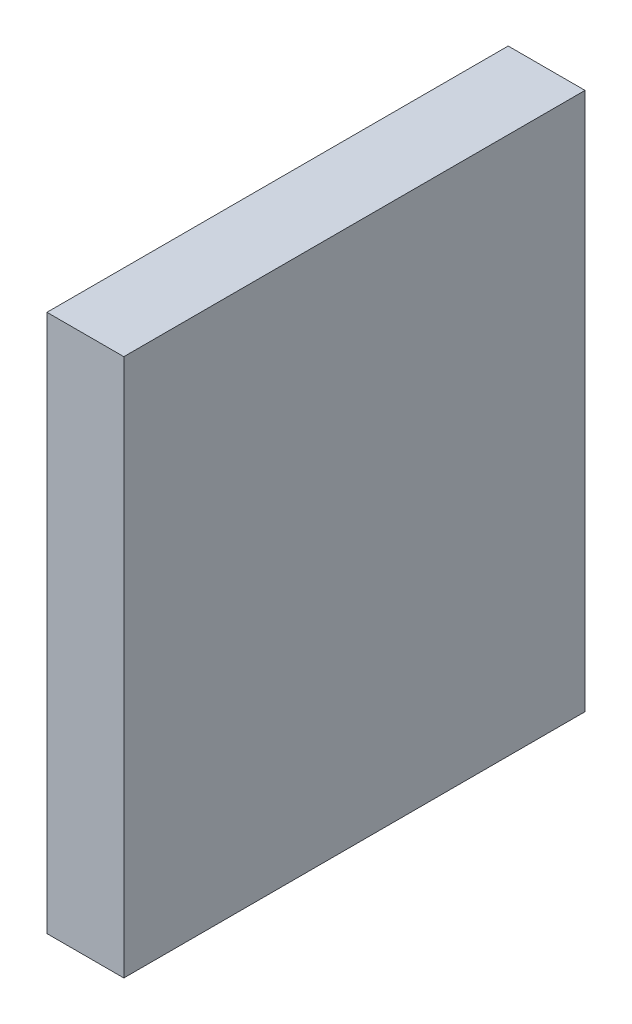
ISO-10303-21;
HEADER;
FILE_DESCRIPTION(('STEP AP214'),'2;1');
FILE_NAME('part.step','',(''),(''),'','','');
FILE_SCHEMA(('AUTOMOTIVE_DESIGN { 1 0 10303 214 1 1 1 1 }'));
ENDSEC;
DATA;
#1=APPLICATION_CONTEXT('core data for automotive mechanical design processes');
#2=APPLICATION_PROTOCOL_DEFINITION('international standard','automotive_design',2000,#1);
#3=PRODUCT_CONTEXT('',#1,'mechanical');
#4=PRODUCT('Part','Part','',(#3));
#5=PRODUCT_RELATED_PRODUCT_CATEGORY('part','',(#4));
#6=PRODUCT_DEFINITION_FORMATION('','',#4);
#7=PRODUCT_DEFINITION_CONTEXT('part definition',#1,'design');
#8=PRODUCT_DEFINITION('design','',#6,#7);
#9=PRODUCT_DEFINITION_SHAPE('','',#8);
#10=(LENGTH_UNIT() NAMED_UNIT(*) SI_UNIT(.MILLI.,.METRE.));
#11=(NAMED_UNIT(*) PLANE_ANGLE_UNIT() SI_UNIT($,.RADIAN.));
#12=(NAMED_UNIT(*) SI_UNIT($,.STERADIAN.) SOLID_ANGLE_UNIT());
#13=UNCERTAINTY_MEASURE_WITH_UNIT(LENGTH_MEASURE(1.E-05),#10,'distance_accuracy_value','');
#14=(GEOMETRIC_REPRESENTATION_CONTEXT(3) GLOBAL_UNCERTAINTY_ASSIGNED_CONTEXT((#13)) GLOBAL_UNIT_ASSIGNED_CONTEXT((#10,
#11,#12)) REPRESENTATION_CONTEXT('',''));
#15=CARTESIAN_POINT('',(0.,0.,0.));
#16=DIRECTION('',(0.,0.,1.));
#17=DIRECTION('',(1.,0.,0.));
#18=AXIS2_PLACEMENT_3D('',#15,#16,#17);
#19=CARTESIAN_POINT('',(24.1,1.87,14.26));
#20=DIRECTION('',(-1.,0.,0.));
#21=DIRECTION('',(0.,0.,1.));
#22=AXIS2_PLACEMENT_3D('',#19,#20,#21);
#23=PLANE('',#22);
#24=DIRECTION('',(0.,0.,1.));
#25=VECTOR('',#24,1.);
#26=CARTESIAN_POINT('',(24.1,2.22,14.56));
#27=LINE('',#26,#25);
#28=CARTESIAN_POINT('',(24.1,2.22,14.56));
#29=VERTEX_POINT('',#28);
#30=CARTESIAN_POINT('',(24.1,2.22,13.96));
#31=VERTEX_POINT('',#30);
#32=EDGE_CURVE('E79',#29,#31,#27,.F.);
#33=ORIENTED_EDGE('',*,*,#32,.F.);
#34=DIRECTION('',(0.,1.,0.));
#35=VECTOR('',#34,1.);
#36=CARTESIAN_POINT('',(24.1,1.52,14.56));
#37=LINE('',#36,#35);
#38=CARTESIAN_POINT('',(24.1,1.52,14.56));
#39=VERTEX_POINT('',#38);
#40=EDGE_CURVE('E55',#39,#29,#37,.T.);
#41=ORIENTED_EDGE('',*,*,#40,.F.);
#42=DIRECTION('',(0.,0.,-1.));
#43=VECTOR('',#42,1.);
#44=CARTESIAN_POINT('',(24.1,1.52,13.96));
#45=LINE('',#44,#43);
#46=CARTESIAN_POINT('',(24.1,1.52,13.96));
#47=VERTEX_POINT('',#46);
#48=EDGE_CURVE('E57',#47,#39,#45,.F.);
#49=ORIENTED_EDGE('',*,*,#48,.F.);
#50=DIRECTION('',(0.,1.,0.));
#51=VECTOR('',#50,1.);
#52=CARTESIAN_POINT('',(24.1,2.22,13.96));
#53=LINE('',#52,#51);
#54=EDGE_CURVE('E20',#31,#47,#53,.F.);
#55=ORIENTED_EDGE('',*,*,#54,.F.);
#56=EDGE_LOOP('',(#33,#41,#49,#55));
#57=FACE_BOUND('',#56,.T.);
#58=ADVANCED_FACE('F17',(#57),#23,.F.);
#59=CARTESIAN_POINT('',(24.1,2.22,13.96));
#60=DIRECTION('',(0.,0.,-1.));
#61=DIRECTION('',(-1.,0.,0.));
#62=AXIS2_PLACEMENT_3D('',#59,#60,#61);
#63=PLANE('',#62);
#64=DIRECTION('',(0.,1.,0.));
#65=VECTOR('',#64,1.);
#66=CARTESIAN_POINT('',(24.,1.87,13.96));
#67=LINE('',#66,#65);
#68=CARTESIAN_POINT('',(24.,2.22,13.96));
#69=VERTEX_POINT('',#68);
#70=CARTESIAN_POINT('',(24.,1.52,13.96));
#71=VERTEX_POINT('',#70);
#72=EDGE_CURVE('E83',#69,#71,#67,.F.);
#73=ORIENTED_EDGE('',*,*,#72,.F.);
#74=DIRECTION('',(1.,0.,0.));
#75=VECTOR('',#74,1.);
#76=CARTESIAN_POINT('',(24.1,2.22,13.96));
#77=LINE('',#76,#75);
#78=EDGE_CURVE('E68',#31,#69,#77,.F.);
#79=ORIENTED_EDGE('',*,*,#78,.F.);
#80=ORIENTED_EDGE('',*,*,#54,.T.);
#81=DIRECTION('',(1.,0.,0.));
#82=VECTOR('',#81,1.);
#83=CARTESIAN_POINT('',(24.1,1.52,13.96));
#84=LINE('',#83,#82);
#85=EDGE_CURVE('E63',#71,#47,#84,.T.);
#86=ORIENTED_EDGE('',*,*,#85,.F.);
#87=EDGE_LOOP('',(#73,#79,#80,#86));
#88=FACE_BOUND('',#87,.T.);
#89=ADVANCED_FACE('F65',(#88),#63,.T.);
#90=CARTESIAN_POINT('',(24.1,1.52,13.96));
#91=DIRECTION('',(0.,-1.,0.));
#92=DIRECTION('',(0.,0.,-1.));
#93=AXIS2_PLACEMENT_3D('',#90,#91,#92);
#94=PLANE('',#93);
#95=DIRECTION('',(0.,0.,1.));
#96=VECTOR('',#95,1.);
#97=CARTESIAN_POINT('',(24.,1.52,14.26));
#98=LINE('',#97,#96);
#99=CARTESIAN_POINT('',(24.,1.52,14.56));
#100=VERTEX_POINT('',#99);
#101=EDGE_CURVE('E72',#71,#100,#98,.T.);
#102=ORIENTED_EDGE('',*,*,#101,.F.);
#103=ORIENTED_EDGE('',*,*,#85,.T.);
#104=ORIENTED_EDGE('',*,*,#48,.T.);
#105=DIRECTION('',(1.,0.,0.));
#106=VECTOR('',#105,1.);
#107=CARTESIAN_POINT('',(24.1,1.52,14.56));
#108=LINE('',#107,#106);
#109=EDGE_CURVE('E75',#100,#39,#108,.T.);
#110=ORIENTED_EDGE('',*,*,#109,.F.);
#111=EDGE_LOOP('',(#102,#103,#104,#110));
#112=FACE_BOUND('',#111,.T.);
#113=ADVANCED_FACE('F70',(#112),#94,.T.);
#114=CARTESIAN_POINT('',(24.1,1.52,14.56));
#115=DIRECTION('',(0.,0.,1.));
#116=DIRECTION('',(1.,0.,0.));
#117=AXIS2_PLACEMENT_3D('',#114,#115,#116);
#118=PLANE('',#117);
#119=DIRECTION('',(0.,1.,0.));
#120=VECTOR('',#119,1.);
#121=CARTESIAN_POINT('',(24.,1.87,14.56));
#122=LINE('',#121,#120);
#123=CARTESIAN_POINT('',(24.,2.22,14.56));
#124=VERTEX_POINT('',#123);
#125=EDGE_CURVE('E26',#100,#124,#122,.T.);
#126=ORIENTED_EDGE('',*,*,#125,.F.);
#127=ORIENTED_EDGE('',*,*,#109,.T.);
#128=ORIENTED_EDGE('',*,*,#40,.T.);
#129=DIRECTION('',(1.,0.,0.));
#130=VECTOR('',#129,1.);
#131=CARTESIAN_POINT('',(24.1,2.22,14.56));
#132=LINE('',#131,#130);
#133=EDGE_CURVE('E35',#124,#29,#132,.T.);
#134=ORIENTED_EDGE('',*,*,#133,.F.);
#135=EDGE_LOOP('',(#126,#127,#128,#134));
#136=FACE_BOUND('',#135,.T.);
#137=ADVANCED_FACE('F89',(#136),#118,.T.);
#138=CARTESIAN_POINT('',(24.1,2.22,14.56));
#139=DIRECTION('',(0.,1.,0.));
#140=DIRECTION('',(0.,0.,1.));
#141=AXIS2_PLACEMENT_3D('',#138,#139,#140);
#142=PLANE('',#141);
#143=DIRECTION('',(0.,0.,1.));
#144=VECTOR('',#143,1.);
#145=CARTESIAN_POINT('',(24.,2.22,14.26));
#146=LINE('',#145,#144);
#147=EDGE_CURVE('E11',#124,#69,#146,.F.);
#148=ORIENTED_EDGE('',*,*,#147,.F.);
#149=ORIENTED_EDGE('',*,*,#133,.T.);
#150=ORIENTED_EDGE('',*,*,#32,.T.);
#151=ORIENTED_EDGE('',*,*,#78,.T.);
#152=EDGE_LOOP('',(#148,#149,#150,#151));
#153=FACE_BOUND('',#152,.T.);
#154=ADVANCED_FACE('F91',(#153),#142,.T.);
#155=CARTESIAN_POINT('',(24.,1.87,14.26));
#156=DIRECTION('',(-1.,0.,0.));
#157=DIRECTION('',(0.,0.,1.));
#158=AXIS2_PLACEMENT_3D('',#155,#156,#157);
#159=PLANE('',#158);
#160=ORIENTED_EDGE('',*,*,#125,.T.);
#161=ORIENTED_EDGE('',*,*,#147,.T.);
#162=ORIENTED_EDGE('',*,*,#72,.T.);
#163=ORIENTED_EDGE('',*,*,#101,.T.);
#164=EDGE_LOOP('',(#160,#161,#162,#163));
#165=FACE_BOUND('',#164,.T.);
#166=ADVANCED_FACE('F88',(#165),#159,.T.);
#167=CLOSED_SHELL('',(#58,#89,#113,#137,#154,#166));
#168=MANIFOLD_SOLID_BREP('B1',#167);
#169=ADVANCED_BREP_SHAPE_REPRESENTATION('',(#18,#168),#14);
#170=SHAPE_DEFINITION_REPRESENTATION(#9,#169);
ENDSEC;
END-ISO-10303-21;
